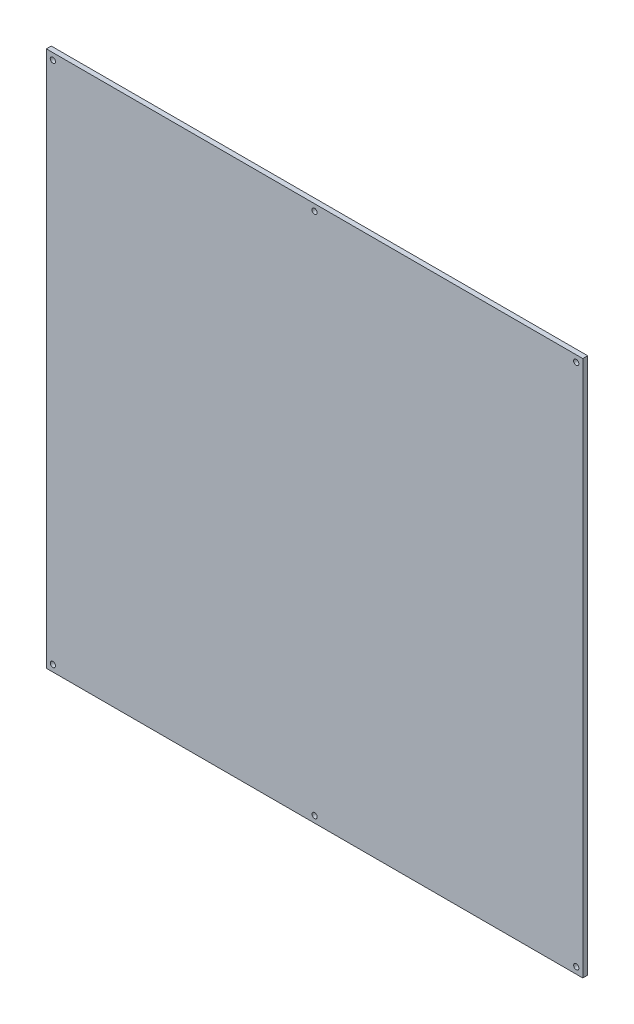
ISO-10303-21;
HEADER;
FILE_DESCRIPTION(('STEP AP214'),'2;1');
FILE_NAME('part.step','',(''),(''),'','','');
FILE_SCHEMA(('AUTOMOTIVE_DESIGN { 1 0 10303 214 1 1 1 1 }'));
ENDSEC;
DATA;
#1=APPLICATION_CONTEXT('core data for automotive mechanical design processes');
#2=APPLICATION_PROTOCOL_DEFINITION('international standard','automotive_design',2000,#1);
#3=PRODUCT_CONTEXT('',#1,'mechanical');
#4=PRODUCT('Part','Part','',(#3));
#5=PRODUCT_RELATED_PRODUCT_CATEGORY('part','',(#4));
#6=PRODUCT_DEFINITION_FORMATION('','',#4);
#7=PRODUCT_DEFINITION_CONTEXT('part definition',#1,'design');
#8=PRODUCT_DEFINITION('design','',#6,#7);
#9=PRODUCT_DEFINITION_SHAPE('','',#8);
#10=(LENGTH_UNIT() NAMED_UNIT(*) SI_UNIT(.MILLI.,.METRE.));
#11=(NAMED_UNIT(*) PLANE_ANGLE_UNIT() SI_UNIT($,.RADIAN.));
#12=(NAMED_UNIT(*) SI_UNIT($,.STERADIAN.) SOLID_ANGLE_UNIT());
#13=UNCERTAINTY_MEASURE_WITH_UNIT(LENGTH_MEASURE(1.E-05),#10,'distance_accuracy_value','');
#14=(GEOMETRIC_REPRESENTATION_CONTEXT(3) GLOBAL_UNCERTAINTY_ASSIGNED_CONTEXT((#13)) GLOBAL_UNIT_ASSIGNED_CONTEXT((#10,
#11,#12)) REPRESENTATION_CONTEXT('',''));
#15=CARTESIAN_POINT('',(0.,0.,0.));
#16=DIRECTION('',(0.,0.,1.));
#17=DIRECTION('',(1.,0.,0.));
#18=AXIS2_PLACEMENT_3D('',#15,#16,#17);
#19=CARTESIAN_POINT('',(0.,0.,3.));
#20=DIRECTION('',(1.,0.,0.));
#21=DIRECTION('',(0.,0.,-1.));
#22=AXIS2_PLACEMENT_3D('',#19,#20,#21);
#23=PLANE('',#22);
#24=DIRECTION('',(0.,-1.,0.));
#25=VECTOR('',#24,1.);
#26=CARTESIAN_POINT('',(0.,0.,0.));
#27=LINE('',#26,#25);
#28=CARTESIAN_POINT('',(0.,328.,0.));
#29=VERTEX_POINT('',#28);
#30=CARTESIAN_POINT('',(0.,0.,0.));
#31=VERTEX_POINT('',#30);
#32=EDGE_CURVE('E110',#29,#31,#27,.T.);
#33=ORIENTED_EDGE('',*,*,#32,.T.);
#34=DIRECTION('',(0.,0.,-1.));
#35=VECTOR('',#34,1.);
#36=CARTESIAN_POINT('',(0.,0.,3.));
#37=LINE('',#36,#35);
#38=CARTESIAN_POINT('',(0.,0.,3.));
#39=VERTEX_POINT('',#38);
#40=EDGE_CURVE('E11',#39,#31,#37,.T.);
#41=ORIENTED_EDGE('',*,*,#40,.F.);
#42=DIRECTION('',(0.,-1.,0.));
#43=VECTOR('',#42,1.);
#44=CARTESIAN_POINT('',(0.,0.,3.));
#45=LINE('',#44,#43);
#46=CARTESIAN_POINT('',(0.,328.,3.));
#47=VERTEX_POINT('',#46);
#48=EDGE_CURVE('E93',#47,#39,#45,.T.);
#49=ORIENTED_EDGE('',*,*,#48,.F.);
#50=DIRECTION('',(0.,0.,-1.));
#51=VECTOR('',#50,1.);
#52=CARTESIAN_POINT('',(0.,328.,3.));
#53=LINE('',#52,#51);
#54=EDGE_CURVE('E106',#47,#29,#53,.T.);
#55=ORIENTED_EDGE('',*,*,#54,.T.);
#56=EDGE_LOOP('',(#33,#41,#49,#55));
#57=FACE_BOUND('',#56,.T.);
#58=ADVANCED_FACE('F38',(#57),#23,.F.);
#59=CARTESIAN_POINT('',(0.,0.,3.));
#60=DIRECTION('',(0.,1.,0.));
#61=DIRECTION('',(0.,0.,1.));
#62=AXIS2_PLACEMENT_3D('',#59,#60,#61);
#63=PLANE('',#62);
#64=DIRECTION('',(1.,0.,0.));
#65=VECTOR('',#64,1.);
#66=CARTESIAN_POINT('',(0.,0.,0.));
#67=LINE('',#66,#65);
#68=CARTESIAN_POINT('',(328.,0.,0.));
#69=VERTEX_POINT('',#68);
#70=EDGE_CURVE('E98',#31,#69,#67,.T.);
#71=ORIENTED_EDGE('',*,*,#70,.T.);
#72=DIRECTION('',(0.,0.,-1.));
#73=VECTOR('',#72,1.);
#74=CARTESIAN_POINT('',(328.,0.,3.));
#75=LINE('',#74,#73);
#76=CARTESIAN_POINT('',(328.,0.,3.));
#77=VERTEX_POINT('',#76);
#78=EDGE_CURVE('E46',#77,#69,#75,.T.);
#79=ORIENTED_EDGE('',*,*,#78,.F.);
#80=DIRECTION('',(1.,0.,0.));
#81=VECTOR('',#80,1.);
#82=CARTESIAN_POINT('',(0.,0.,3.));
#83=LINE('',#82,#81);
#84=EDGE_CURVE('E88',#39,#77,#83,.T.);
#85=ORIENTED_EDGE('',*,*,#84,.F.);
#86=ORIENTED_EDGE('',*,*,#40,.T.);
#87=EDGE_LOOP('',(#71,#79,#85,#86));
#88=FACE_BOUND('',#87,.T.);
#89=ADVANCED_FACE('F97',(#88),#63,.F.);
#90=CARTESIAN_POINT('',(328.,0.,3.));
#91=DIRECTION('',(-1.,0.,0.));
#92=DIRECTION('',(0.,0.,1.));
#93=AXIS2_PLACEMENT_3D('',#90,#91,#92);
#94=PLANE('',#93);
#95=DIRECTION('',(0.,1.,0.));
#96=VECTOR('',#95,1.);
#97=CARTESIAN_POINT('',(328.,0.,0.));
#98=LINE('',#97,#96);
#99=CARTESIAN_POINT('',(328.,328.,0.));
#100=VERTEX_POINT('',#99);
#101=EDGE_CURVE('E75',#69,#100,#98,.T.);
#102=ORIENTED_EDGE('',*,*,#101,.T.);
#103=DIRECTION('',(0.,0.,-1.));
#104=VECTOR('',#103,1.);
#105=CARTESIAN_POINT('',(328.,328.,3.));
#106=LINE('',#105,#104);
#107=CARTESIAN_POINT('',(328.,328.,3.));
#108=VERTEX_POINT('',#107);
#109=EDGE_CURVE('E99',#108,#100,#106,.T.);
#110=ORIENTED_EDGE('',*,*,#109,.F.);
#111=DIRECTION('',(0.,1.,0.));
#112=VECTOR('',#111,1.);
#113=CARTESIAN_POINT('',(328.,0.,3.));
#114=LINE('',#113,#112);
#115=EDGE_CURVE('E91',#77,#108,#114,.T.);
#116=ORIENTED_EDGE('',*,*,#115,.F.);
#117=ORIENTED_EDGE('',*,*,#78,.T.);
#118=EDGE_LOOP('',(#102,#110,#116,#117));
#119=FACE_BOUND('',#118,.T.);
#120=ADVANCED_FACE('F100',(#119),#94,.F.);
#121=CARTESIAN_POINT('',(0.,328.,3.));
#122=DIRECTION('',(0.,-1.,0.));
#123=DIRECTION('',(0.,0.,-1.));
#124=AXIS2_PLACEMENT_3D('',#121,#122,#123);
#125=PLANE('',#124);
#126=DIRECTION('',(-1.,0.,0.));
#127=VECTOR('',#126,1.);
#128=CARTESIAN_POINT('',(0.,328.,0.));
#129=LINE('',#128,#127);
#130=EDGE_CURVE('E81',#100,#29,#129,.T.);
#131=ORIENTED_EDGE('',*,*,#130,.T.);
#132=ORIENTED_EDGE('',*,*,#54,.F.);
#133=DIRECTION('',(-1.,0.,0.));
#134=VECTOR('',#133,1.);
#135=CARTESIAN_POINT('',(0.,328.,3.));
#136=LINE('',#135,#134);
#137=EDGE_CURVE('E56',#108,#47,#136,.T.);
#138=ORIENTED_EDGE('',*,*,#137,.F.);
#139=ORIENTED_EDGE('',*,*,#109,.T.);
#140=EDGE_LOOP('',(#131,#132,#138,#139));
#141=FACE_BOUND('',#140,.T.);
#142=ADVANCED_FACE('F124',(#141),#125,.F.);
#143=CARTESIAN_POINT('',(0.,0.,3.));
#144=DIRECTION('',(0.,0.,-1.));
#145=DIRECTION('',(-1.,0.,0.));
#146=AXIS2_PLACEMENT_3D('',#143,#144,#145);
#147=PLANE('',#146);
#148=CARTESIAN_POINT('',(4.,4.,3.));
#149=DIRECTION('',(0.,0.,1.));
#150=DIRECTION('',(-1.,0.,0.));
#151=AXIS2_PLACEMENT_3D('',#148,#149,#150);
#152=CIRCLE('',#151,1.59999999999999);
#153=CARTESIAN_POINT('',(2.40000000000001,4.,3.));
#154=VERTEX_POINT('',#153);
#155=EDGE_CURVE('E142',#154,#154,#152,.T.);
#156=ORIENTED_EDGE('',*,*,#155,.F.);
#157=EDGE_LOOP('',(#156));
#158=FACE_BOUND('',#157,.T.);
#159=CARTESIAN_POINT('',(164.,4.,3.));
#160=DIRECTION('',(0.,0.,1.));
#161=DIRECTION('',(-1.,0.,0.));
#162=AXIS2_PLACEMENT_3D('',#159,#160,#161);
#163=CIRCLE('',#162,1.59999999999999);
#164=CARTESIAN_POINT('',(162.4,4.,3.));
#165=VERTEX_POINT('',#164);
#166=EDGE_CURVE('E141',#165,#165,#163,.T.);
#167=ORIENTED_EDGE('',*,*,#166,.F.);
#168=EDGE_LOOP('',(#167));
#169=FACE_BOUND('',#168,.T.);
#170=CARTESIAN_POINT('',(324.,4.,3.));
#171=DIRECTION('',(0.,0.,1.));
#172=DIRECTION('',(-1.,0.,0.));
#173=AXIS2_PLACEMENT_3D('',#170,#171,#172);
#174=CIRCLE('',#173,1.59999999999996);
#175=CARTESIAN_POINT('',(322.4,4.,3.));
#176=VERTEX_POINT('',#175);
#177=EDGE_CURVE('E148',#176,#176,#174,.T.);
#178=ORIENTED_EDGE('',*,*,#177,.F.);
#179=EDGE_LOOP('',(#178));
#180=FACE_BOUND('',#179,.T.);
#181=CARTESIAN_POINT('',(324.,324.,3.));
#182=DIRECTION('',(0.,0.,1.));
#183=DIRECTION('',(1.,0.,0.));
#184=AXIS2_PLACEMENT_3D('',#181,#182,#183);
#185=CIRCLE('',#184,1.59999999999996);
#186=CARTESIAN_POINT('',(325.6,324.,3.));
#187=VERTEX_POINT('',#186);
#188=EDGE_CURVE('E154',#187,#187,#185,.T.);
#189=ORIENTED_EDGE('',*,*,#188,.F.);
#190=EDGE_LOOP('',(#189));
#191=FACE_BOUND('',#190,.T.);
#192=CARTESIAN_POINT('',(164.,324.,3.));
#193=DIRECTION('',(0.,0.,1.));
#194=DIRECTION('',(1.,0.,0.));
#195=AXIS2_PLACEMENT_3D('',#192,#193,#194);
#196=CIRCLE('',#195,1.59999999999999);
#197=CARTESIAN_POINT('',(165.6,324.,3.));
#198=VERTEX_POINT('',#197);
#199=EDGE_CURVE('E160',#198,#198,#196,.T.);
#200=ORIENTED_EDGE('',*,*,#199,.F.);
#201=EDGE_LOOP('',(#200));
#202=FACE_BOUND('',#201,.T.);
#203=CARTESIAN_POINT('',(4.,324.,3.));
#204=DIRECTION('',(0.,0.,1.));
#205=DIRECTION('',(1.,0.,0.));
#206=AXIS2_PLACEMENT_3D('',#203,#204,#205);
#207=CIRCLE('',#206,1.59999999999999);
#208=CARTESIAN_POINT('',(5.59999999999999,324.,3.));
#209=VERTEX_POINT('',#208);
#210=EDGE_CURVE('E133',#209,#209,#207,.T.);
#211=ORIENTED_EDGE('',*,*,#210,.F.);
#212=EDGE_LOOP('',(#211));
#213=FACE_BOUND('',#212,.T.);
#214=ORIENTED_EDGE('',*,*,#48,.T.);
#215=ORIENTED_EDGE('',*,*,#84,.T.);
#216=ORIENTED_EDGE('',*,*,#115,.T.);
#217=ORIENTED_EDGE('',*,*,#137,.T.);
#218=EDGE_LOOP('',(#214,#215,#216,#217));
#219=FACE_BOUND('',#218,.T.);
#220=ADVANCED_FACE('F89',(#158,#169,#180,#191,#202,#213,#219),#147,.F.);
#221=CARTESIAN_POINT('',(0.,0.,0.));
#222=DIRECTION('',(0.,0.,-1.));
#223=DIRECTION('',(-1.,0.,0.));
#224=AXIS2_PLACEMENT_3D('',#221,#222,#223);
#225=PLANE('',#224);
#226=CARTESIAN_POINT('',(4.,4.,0.));
#227=DIRECTION('',(0.,0.,-1.));
#228=DIRECTION('',(-1.,0.,0.));
#229=AXIS2_PLACEMENT_3D('',#226,#227,#228);
#230=CIRCLE('',#229,1.59999999999999);
#231=CARTESIAN_POINT('',(2.40000000000001,4.,0.));
#232=VERTEX_POINT('',#231);
#233=EDGE_CURVE('E138',#232,#232,#230,.F.);
#234=ORIENTED_EDGE('',*,*,#233,.T.);
#235=EDGE_LOOP('',(#234));
#236=FACE_BOUND('',#235,.T.);
#237=CARTESIAN_POINT('',(164.,4.,0.));
#238=DIRECTION('',(0.,0.,-1.));
#239=DIRECTION('',(-1.,0.,0.));
#240=AXIS2_PLACEMENT_3D('',#237,#238,#239);
#241=CIRCLE('',#240,1.59999999999999);
#242=CARTESIAN_POINT('',(162.4,4.,0.));
#243=VERTEX_POINT('',#242);
#244=EDGE_CURVE('E145',#243,#243,#241,.F.);
#245=ORIENTED_EDGE('',*,*,#244,.T.);
#246=EDGE_LOOP('',(#245));
#247=FACE_BOUND('',#246,.T.);
#248=CARTESIAN_POINT('',(324.,4.,0.));
#249=DIRECTION('',(0.,0.,-1.));
#250=DIRECTION('',(-1.,0.,0.));
#251=AXIS2_PLACEMENT_3D('',#248,#249,#250);
#252=CIRCLE('',#251,1.59999999999996);
#253=CARTESIAN_POINT('',(322.4,4.,0.));
#254=VERTEX_POINT('',#253);
#255=EDGE_CURVE('E151',#254,#254,#252,.F.);
#256=ORIENTED_EDGE('',*,*,#255,.T.);
#257=EDGE_LOOP('',(#256));
#258=FACE_BOUND('',#257,.T.);
#259=CARTESIAN_POINT('',(324.,324.,0.));
#260=DIRECTION('',(0.,0.,-1.));
#261=DIRECTION('',(-1.,0.,0.));
#262=AXIS2_PLACEMENT_3D('',#259,#260,#261);
#263=CIRCLE('',#262,1.59999999999996);
#264=CARTESIAN_POINT('',(322.4,324.,0.));
#265=VERTEX_POINT('',#264);
#266=EDGE_CURVE('E157',#265,#265,#263,.F.);
#267=ORIENTED_EDGE('',*,*,#266,.T.);
#268=EDGE_LOOP('',(#267));
#269=FACE_BOUND('',#268,.T.);
#270=CARTESIAN_POINT('',(164.,324.,0.));
#271=DIRECTION('',(0.,0.,-1.));
#272=DIRECTION('',(-1.,0.,0.));
#273=AXIS2_PLACEMENT_3D('',#270,#271,#272);
#274=CIRCLE('',#273,1.59999999999999);
#275=CARTESIAN_POINT('',(162.4,324.,0.));
#276=VERTEX_POINT('',#275);
#277=EDGE_CURVE('E137',#276,#276,#274,.F.);
#278=ORIENTED_EDGE('',*,*,#277,.T.);
#279=EDGE_LOOP('',(#278));
#280=FACE_BOUND('',#279,.T.);
#281=CARTESIAN_POINT('',(4.,324.,0.));
#282=DIRECTION('',(0.,0.,-1.));
#283=DIRECTION('',(-1.,0.,0.));
#284=AXIS2_PLACEMENT_3D('',#281,#282,#283);
#285=CIRCLE('',#284,1.59999999999999);
#286=CARTESIAN_POINT('',(2.40000000000002,324.,0.));
#287=VERTEX_POINT('',#286);
#288=EDGE_CURVE('E114',#287,#287,#285,.F.);
#289=ORIENTED_EDGE('',*,*,#288,.T.);
#290=EDGE_LOOP('',(#289));
#291=FACE_BOUND('',#290,.T.);
#292=ORIENTED_EDGE('',*,*,#32,.F.);
#293=ORIENTED_EDGE('',*,*,#130,.F.);
#294=ORIENTED_EDGE('',*,*,#101,.F.);
#295=ORIENTED_EDGE('',*,*,#70,.F.);
#296=EDGE_LOOP('',(#292,#293,#294,#295));
#297=FACE_BOUND('',#296,.T.);
#298=ADVANCED_FACE('F127',(#236,#247,#258,#269,#280,#291,#297),#225,.T.);
#299=CARTESIAN_POINT('',(4.,324.,-4.52548339959388));
#300=DIRECTION('',(0.,0.,1.));
#301=DIRECTION('',(1.,0.,0.));
#302=AXIS2_PLACEMENT_3D('',#299,#300,#301);
#303=CYLINDRICAL_SURFACE('',#302,1.59999999999999);
#304=ORIENTED_EDGE('',*,*,#210,.T.);
#305=EDGE_LOOP('',(#304));
#306=FACE_BOUND('',#305,.T.);
#307=ORIENTED_EDGE('',*,*,#288,.F.);
#308=EDGE_LOOP('',(#307));
#309=FACE_BOUND('',#308,.T.);
#310=ADVANCED_FACE('F180',(#306,#309),#303,.F.);
#311=CARTESIAN_POINT('',(164.,324.,-4.52548339959388));
#312=DIRECTION('',(0.,0.,1.));
#313=DIRECTION('',(1.,0.,0.));
#314=AXIS2_PLACEMENT_3D('',#311,#312,#313);
#315=CYLINDRICAL_SURFACE('',#314,1.59999999999999);
#316=ORIENTED_EDGE('',*,*,#199,.T.);
#317=EDGE_LOOP('',(#316));
#318=FACE_BOUND('',#317,.T.);
#319=ORIENTED_EDGE('',*,*,#277,.F.);
#320=EDGE_LOOP('',(#319));
#321=FACE_BOUND('',#320,.T.);
#322=ADVANCED_FACE('F171',(#318,#321),#315,.F.);
#323=CARTESIAN_POINT('',(324.,324.,-4.52548339959388));
#324=DIRECTION('',(0.,0.,1.));
#325=DIRECTION('',(1.,0.,0.));
#326=AXIS2_PLACEMENT_3D('',#323,#324,#325);
#327=CYLINDRICAL_SURFACE('',#326,1.59999999999996);
#328=ORIENTED_EDGE('',*,*,#188,.T.);
#329=EDGE_LOOP('',(#328));
#330=FACE_BOUND('',#329,.T.);
#331=ORIENTED_EDGE('',*,*,#266,.F.);
#332=EDGE_LOOP('',(#331));
#333=FACE_BOUND('',#332,.T.);
#334=ADVANCED_FACE('F229',(#330,#333),#327,.F.);
#335=CARTESIAN_POINT('',(324.,4.,-4.52548339959388));
#336=DIRECTION('',(0.,0.,1.));
#337=DIRECTION('',(1.,0.,0.));
#338=AXIS2_PLACEMENT_3D('',#335,#336,#337);
#339=CYLINDRICAL_SURFACE('',#338,1.59999999999996);
#340=ORIENTED_EDGE('',*,*,#177,.T.);
#341=EDGE_LOOP('',(#340));
#342=FACE_BOUND('',#341,.T.);
#343=ORIENTED_EDGE('',*,*,#255,.F.);
#344=EDGE_LOOP('',(#343));
#345=FACE_BOUND('',#344,.T.);
#346=ADVANCED_FACE('F238',(#342,#345),#339,.F.);
#347=CARTESIAN_POINT('',(164.,4.,-4.52548339959388));
#348=DIRECTION('',(0.,0.,1.));
#349=DIRECTION('',(1.,0.,0.));
#350=AXIS2_PLACEMENT_3D('',#347,#348,#349);
#351=CYLINDRICAL_SURFACE('',#350,1.59999999999999);
#352=ORIENTED_EDGE('',*,*,#166,.T.);
#353=EDGE_LOOP('',(#352));
#354=FACE_BOUND('',#353,.T.);
#355=ORIENTED_EDGE('',*,*,#244,.F.);
#356=EDGE_LOOP('',(#355));
#357=FACE_BOUND('',#356,.T.);
#358=ADVANCED_FACE('F248',(#354,#357),#351,.F.);
#359=CARTESIAN_POINT('',(4.,4.,-4.52548339959388));
#360=DIRECTION('',(0.,0.,1.));
#361=DIRECTION('',(1.,0.,0.));
#362=AXIS2_PLACEMENT_3D('',#359,#360,#361);
#363=CYLINDRICAL_SURFACE('',#362,1.59999999999999);
#364=ORIENTED_EDGE('',*,*,#155,.T.);
#365=EDGE_LOOP('',(#364));
#366=FACE_BOUND('',#365,.T.);
#367=ORIENTED_EDGE('',*,*,#233,.F.);
#368=EDGE_LOOP('',(#367));
#369=FACE_BOUND('',#368,.T.);
#370=ADVANCED_FACE('F258',(#366,#369),#363,.F.);
#371=CLOSED_SHELL('',(#58,#89,#120,#142,#220,#298,#310,#322,#334,#346,#358,#370));
#372=MANIFOLD_SOLID_BREP('B2',#371);
#373=ADVANCED_BREP_SHAPE_REPRESENTATION('',(#18,#372),#14);
#374=SHAPE_DEFINITION_REPRESENTATION(#9,#373);
ENDSEC;
END-ISO-10303-21;
